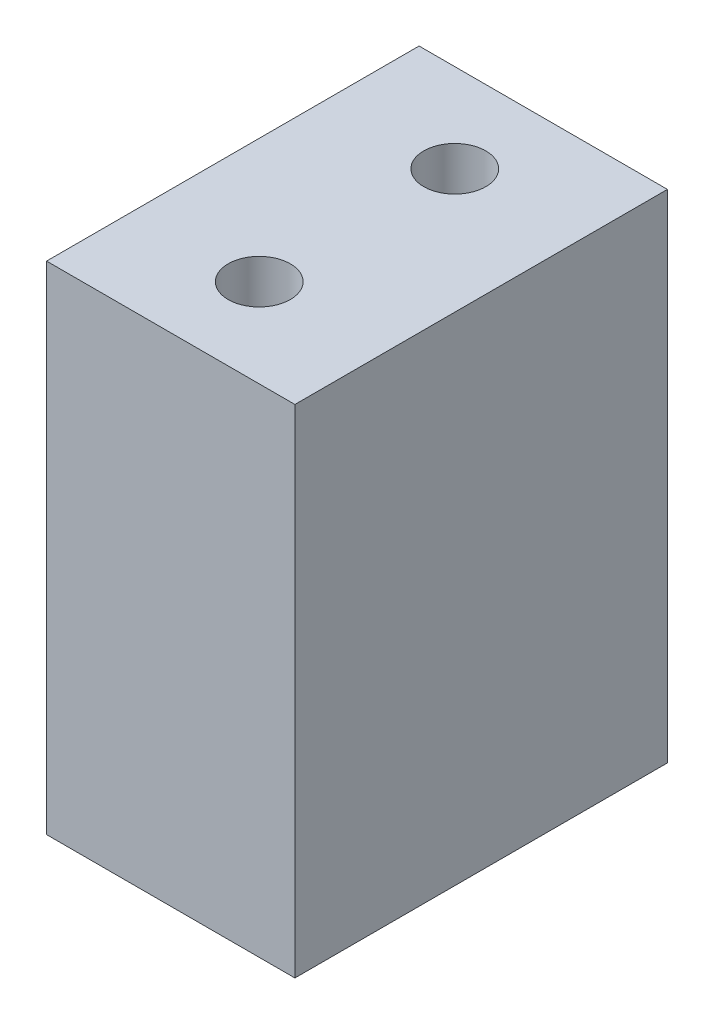
ISO-10303-21;
HEADER;
FILE_DESCRIPTION(('STEP AP214'),'2;1');
FILE_NAME('part.step','',(''),(''),'','','');
FILE_SCHEMA(('AUTOMOTIVE_DESIGN { 1 0 10303 214 1 1 1 1 }'));
ENDSEC;
DATA;
#1=APPLICATION_CONTEXT('core data for automotive mechanical design processes');
#2=APPLICATION_PROTOCOL_DEFINITION('international standard','automotive_design',2000,#1);
#3=PRODUCT_CONTEXT('',#1,'mechanical');
#4=PRODUCT('Part','Part','',(#3));
#5=PRODUCT_RELATED_PRODUCT_CATEGORY('part','',(#4));
#6=PRODUCT_DEFINITION_FORMATION('','',#4);
#7=PRODUCT_DEFINITION_CONTEXT('part definition',#1,'design');
#8=PRODUCT_DEFINITION('design','',#6,#7);
#9=PRODUCT_DEFINITION_SHAPE('','',#8);
#10=(LENGTH_UNIT() NAMED_UNIT(*) SI_UNIT(.MILLI.,.METRE.));
#11=(NAMED_UNIT(*) PLANE_ANGLE_UNIT() SI_UNIT($,.RADIAN.));
#12=(NAMED_UNIT(*) SI_UNIT($,.STERADIAN.) SOLID_ANGLE_UNIT());
#13=UNCERTAINTY_MEASURE_WITH_UNIT(LENGTH_MEASURE(1.E-05),#10,'distance_accuracy_value','');
#14=(GEOMETRIC_REPRESENTATION_CONTEXT(3) GLOBAL_UNCERTAINTY_ASSIGNED_CONTEXT((#13)) GLOBAL_UNIT_ASSIGNED_CONTEXT((#10,
#11,#12)) REPRESENTATION_CONTEXT('',''));
#15=CARTESIAN_POINT('',(0.,0.,0.));
#16=DIRECTION('',(0.,0.,1.));
#17=DIRECTION('',(1.,0.,0.));
#18=AXIS2_PLACEMENT_3D('',#15,#16,#17);
#19=CARTESIAN_POINT('',(0.,50.8,0.));
#20=DIRECTION('',(0.,-1.,0.));
#21=DIRECTION('',(0.,0.,-1.));
#22=AXIS2_PLACEMENT_3D('',#19,#20,#21);
#23=PLANE('',#22);
#24=DIRECTION('',(0.,0.,-1.));
#25=VECTOR('',#24,1.);
#26=CARTESIAN_POINT('',(12.7,50.8,19.05));
#27=LINE('',#26,#25);
#28=CARTESIAN_POINT('',(12.7,50.8,19.05));
#29=VERTEX_POINT('',#28);
#30=CARTESIAN_POINT('',(12.7,50.8,-19.05));
#31=VERTEX_POINT('',#30);
#32=EDGE_CURVE('E87',#29,#31,#27,.T.);
#33=ORIENTED_EDGE('',*,*,#32,.T.);
#34=DIRECTION('',(-1.,0.,0.));
#35=VECTOR('',#34,1.);
#36=CARTESIAN_POINT('',(-12.7,50.8,-19.05));
#37=LINE('',#36,#35);
#38=CARTESIAN_POINT('',(-12.7,50.8,-19.05));
#39=VERTEX_POINT('',#38);
#40=EDGE_CURVE('E82',#31,#39,#37,.T.);
#41=ORIENTED_EDGE('',*,*,#40,.T.);
#42=DIRECTION('',(0.,0.,1.));
#43=VECTOR('',#42,1.);
#44=CARTESIAN_POINT('',(-12.7,50.8,19.05));
#45=LINE('',#44,#43);
#46=CARTESIAN_POINT('',(-12.7,50.8,19.05));
#47=VERTEX_POINT('',#46);
#48=EDGE_CURVE('E85',#39,#47,#45,.T.);
#49=ORIENTED_EDGE('',*,*,#48,.T.);
#50=DIRECTION('',(1.,0.,0.));
#51=VECTOR('',#50,1.);
#52=CARTESIAN_POINT('',(-12.7,50.8,19.05));
#53=LINE('',#52,#51);
#54=EDGE_CURVE('E52',#47,#29,#53,.T.);
#55=ORIENTED_EDGE('',*,*,#54,.T.);
#56=EDGE_LOOP('',(#33,#41,#49,#55));
#57=FACE_BOUND('',#56,.T.);
#58=CARTESIAN_POINT('',(0.,50.8,-9.999999939));
#59=DIRECTION('',(0.,1.,0.));
#60=DIRECTION('',(0.,0.,1.));
#61=AXIS2_PLACEMENT_3D('',#58,#59,#60);
#62=CIRCLE('',#61,3.175);
#63=CARTESIAN_POINT('',(0.,50.8,-6.824999939));
#64=VERTEX_POINT('',#63);
#65=EDGE_CURVE('E102',#64,#64,#62,.T.);
#66=ORIENTED_EDGE('',*,*,#65,.F.);
#67=EDGE_LOOP('',(#66));
#68=FACE_BOUND('',#67,.T.);
#69=CARTESIAN_POINT('',(0.,50.8,9.999999939));
#70=DIRECTION('',(0.,1.,0.));
#71=DIRECTION('',(0.,0.,1.));
#72=AXIS2_PLACEMENT_3D('',#69,#70,#71);
#73=CIRCLE('',#72,3.175);
#74=CARTESIAN_POINT('',(0.,50.8,13.174999939));
#75=VERTEX_POINT('',#74);
#76=EDGE_CURVE('E117',#75,#75,#73,.T.);
#77=ORIENTED_EDGE('',*,*,#76,.F.);
#78=EDGE_LOOP('',(#77));
#79=FACE_BOUND('',#78,.T.);
#80=ADVANCED_FACE('F35',(#57,#68,#79),#23,.F.);
#81=CARTESIAN_POINT('',(0.,0.,0.));
#82=DIRECTION('',(0.,-1.,0.));
#83=DIRECTION('',(0.,0.,-1.));
#84=AXIS2_PLACEMENT_3D('',#81,#82,#83);
#85=PLANE('',#84);
#86=CARTESIAN_POINT('',(0.,0.,-9.999999939));
#87=DIRECTION('',(0.,1.,0.));
#88=DIRECTION('',(0.,0.,1.));
#89=AXIS2_PLACEMENT_3D('',#86,#87,#88);
#90=CIRCLE('',#89,3.175);
#91=CARTESIAN_POINT('',(0.,0.,-6.824999939));
#92=VERTEX_POINT('',#91);
#93=EDGE_CURVE('E114',#92,#92,#90,.T.);
#94=ORIENTED_EDGE('',*,*,#93,.T.);
#95=EDGE_LOOP('',(#94));
#96=FACE_BOUND('',#95,.T.);
#97=DIRECTION('',(0.,0.,-1.));
#98=VECTOR('',#97,1.);
#99=CARTESIAN_POINT('',(12.7,0.,19.05));
#100=LINE('',#99,#98);
#101=CARTESIAN_POINT('',(12.7,0.,19.05));
#102=VERTEX_POINT('',#101);
#103=CARTESIAN_POINT('',(12.7,0.,-19.05));
#104=VERTEX_POINT('',#103);
#105=EDGE_CURVE('E99',#102,#104,#100,.T.);
#106=ORIENTED_EDGE('',*,*,#105,.F.);
#107=DIRECTION('',(1.,0.,0.));
#108=VECTOR('',#107,1.);
#109=CARTESIAN_POINT('',(-12.7,0.,19.05));
#110=LINE('',#109,#108);
#111=CARTESIAN_POINT('',(-12.7,0.,19.05));
#112=VERTEX_POINT('',#111);
#113=EDGE_CURVE('E75',#112,#102,#110,.T.);
#114=ORIENTED_EDGE('',*,*,#113,.F.);
#115=DIRECTION('',(0.,0.,1.));
#116=VECTOR('',#115,1.);
#117=CARTESIAN_POINT('',(-12.7,0.,19.05));
#118=LINE('',#117,#116);
#119=CARTESIAN_POINT('',(-12.7,0.,-19.05));
#120=VERTEX_POINT('',#119);
#121=EDGE_CURVE('E69',#120,#112,#118,.T.);
#122=ORIENTED_EDGE('',*,*,#121,.F.);
#123=DIRECTION('',(-1.,0.,0.));
#124=VECTOR('',#123,1.);
#125=CARTESIAN_POINT('',(-12.7,0.,-19.05));
#126=LINE('',#125,#124);
#127=EDGE_CURVE('E91',#104,#120,#126,.T.);
#128=ORIENTED_EDGE('',*,*,#127,.F.);
#129=EDGE_LOOP('',(#106,#114,#122,#128));
#130=FACE_BOUND('',#129,.T.);
#131=CARTESIAN_POINT('',(0.,0.,9.999999939));
#132=DIRECTION('',(0.,1.,0.));
#133=DIRECTION('',(0.,0.,1.));
#134=AXIS2_PLACEMENT_3D('',#131,#132,#133);
#135=CIRCLE('',#134,3.175);
#136=CARTESIAN_POINT('',(0.,0.,13.174999939));
#137=VERTEX_POINT('',#136);
#138=EDGE_CURVE('E120',#137,#137,#135,.T.);
#139=ORIENTED_EDGE('',*,*,#138,.T.);
#140=EDGE_LOOP('',(#139));
#141=FACE_BOUND('',#140,.T.);
#142=ADVANCED_FACE('F110',(#96,#130,#141),#85,.T.);
#143=CARTESIAN_POINT('',(12.7,50.8,19.05));
#144=DIRECTION('',(-1.,0.,0.));
#145=DIRECTION('',(0.,0.,1.));
#146=AXIS2_PLACEMENT_3D('',#143,#144,#145);
#147=PLANE('',#146);
#148=ORIENTED_EDGE('',*,*,#105,.T.);
#149=DIRECTION('',(0.,-1.,0.));
#150=VECTOR('',#149,1.);
#151=CARTESIAN_POINT('',(12.7,50.8,-19.05));
#152=LINE('',#151,#150);
#153=EDGE_CURVE('E11',#31,#104,#152,.T.);
#154=ORIENTED_EDGE('',*,*,#153,.F.);
#155=ORIENTED_EDGE('',*,*,#32,.F.);
#156=DIRECTION('',(0.,-1.,0.));
#157=VECTOR('',#156,1.);
#158=CARTESIAN_POINT('',(12.7,50.8,19.05));
#159=LINE('',#158,#157);
#160=EDGE_CURVE('E95',#29,#102,#159,.T.);
#161=ORIENTED_EDGE('',*,*,#160,.T.);
#162=EDGE_LOOP('',(#148,#154,#155,#161));
#163=FACE_BOUND('',#162,.T.);
#164=ADVANCED_FACE('F37',(#163),#147,.F.);
#165=CARTESIAN_POINT('',(-12.7,50.8,-19.05));
#166=DIRECTION('',(0.,0.,1.));
#167=DIRECTION('',(1.,0.,0.));
#168=AXIS2_PLACEMENT_3D('',#165,#166,#167);
#169=PLANE('',#168);
#170=ORIENTED_EDGE('',*,*,#127,.T.);
#171=DIRECTION('',(0.,-1.,0.));
#172=VECTOR('',#171,1.);
#173=CARTESIAN_POINT('',(-12.7,50.8,-19.05));
#174=LINE('',#173,#172);
#175=EDGE_CURVE('E44',#39,#120,#174,.T.);
#176=ORIENTED_EDGE('',*,*,#175,.F.);
#177=ORIENTED_EDGE('',*,*,#40,.F.);
#178=ORIENTED_EDGE('',*,*,#153,.T.);
#179=EDGE_LOOP('',(#170,#176,#177,#178));
#180=FACE_BOUND('',#179,.T.);
#181=ADVANCED_FACE('F90',(#180),#169,.F.);
#182=CARTESIAN_POINT('',(-12.7,50.8,19.05));
#183=DIRECTION('',(1.,0.,0.));
#184=DIRECTION('',(0.,0.,-1.));
#185=AXIS2_PLACEMENT_3D('',#182,#183,#184);
#186=PLANE('',#185);
#187=ORIENTED_EDGE('',*,*,#121,.T.);
#188=DIRECTION('',(0.,-1.,0.));
#189=VECTOR('',#188,1.);
#190=CARTESIAN_POINT('',(-12.7,50.8,19.05));
#191=LINE('',#190,#189);
#192=EDGE_CURVE('E92',#47,#112,#191,.T.);
#193=ORIENTED_EDGE('',*,*,#192,.F.);
#194=ORIENTED_EDGE('',*,*,#48,.F.);
#195=ORIENTED_EDGE('',*,*,#175,.T.);
#196=EDGE_LOOP('',(#187,#193,#194,#195));
#197=FACE_BOUND('',#196,.T.);
#198=ADVANCED_FACE('F93',(#197),#186,.F.);
#199=CARTESIAN_POINT('',(-12.7,50.8,19.05));
#200=DIRECTION('',(0.,0.,-1.));
#201=DIRECTION('',(-1.,0.,0.));
#202=AXIS2_PLACEMENT_3D('',#199,#200,#201);
#203=PLANE('',#202);
#204=ORIENTED_EDGE('',*,*,#113,.T.);
#205=ORIENTED_EDGE('',*,*,#160,.F.);
#206=ORIENTED_EDGE('',*,*,#54,.F.);
#207=ORIENTED_EDGE('',*,*,#192,.T.);
#208=EDGE_LOOP('',(#204,#205,#206,#207));
#209=FACE_BOUND('',#208,.T.);
#210=ADVANCED_FACE('F107',(#209),#203,.F.);
#211=CARTESIAN_POINT('',(0.,50.8,-9.999999939));
#212=DIRECTION('',(0.,-1.,0.));
#213=DIRECTION('',(0.,0.,-1.));
#214=AXIS2_PLACEMENT_3D('',#211,#212,#213);
#215=CYLINDRICAL_SURFACE('',#214,3.175);
#216=ORIENTED_EDGE('',*,*,#65,.T.);
#217=EDGE_LOOP('',(#216));
#218=FACE_BOUND('',#217,.T.);
#219=ORIENTED_EDGE('',*,*,#93,.F.);
#220=EDGE_LOOP('',(#219));
#221=FACE_BOUND('',#220,.T.);
#222=ADVANCED_FACE('F137',(#218,#221),#215,.F.);
#223=CARTESIAN_POINT('',(0.,50.8,9.999999939));
#224=DIRECTION('',(0.,-1.,0.));
#225=DIRECTION('',(0.,0.,-1.));
#226=AXIS2_PLACEMENT_3D('',#223,#224,#225);
#227=CYLINDRICAL_SURFACE('',#226,3.175);
#228=ORIENTED_EDGE('',*,*,#76,.T.);
#229=EDGE_LOOP('',(#228));
#230=FACE_BOUND('',#229,.T.);
#231=ORIENTED_EDGE('',*,*,#138,.F.);
#232=EDGE_LOOP('',(#231));
#233=FACE_BOUND('',#232,.T.);
#234=ADVANCED_FACE('F126',(#230,#233),#227,.F.);
#235=CLOSED_SHELL('',(#80,#142,#164,#181,#198,#210,#222,#234));
#236=MANIFOLD_SOLID_BREP('B2',#235);
#237=ADVANCED_BREP_SHAPE_REPRESENTATION('',(#18,#236),#14);
#238=SHAPE_DEFINITION_REPRESENTATION(#9,#237);
ENDSEC;
END-ISO-10303-21;
